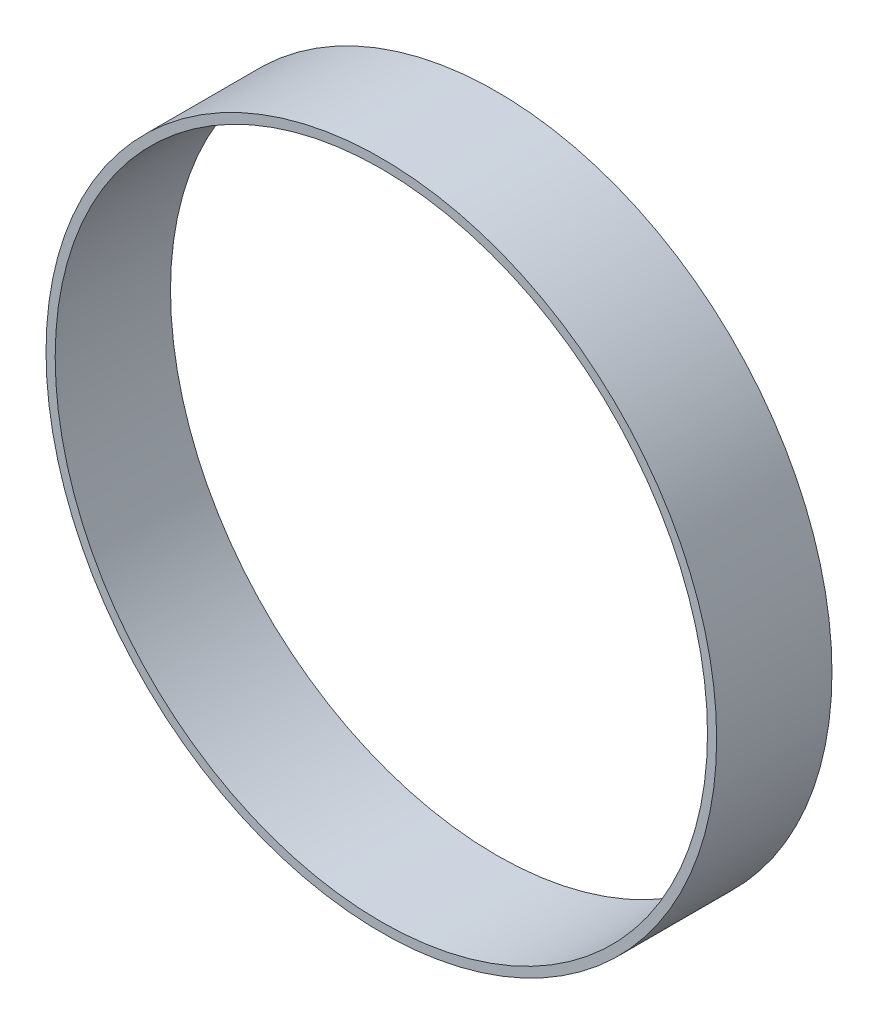
ISO-10303-21;
HEADER;
FILE_DESCRIPTION(('STEP AP214'),'2;1');
FILE_NAME('part.step','',(''),(''),'','','');
FILE_SCHEMA(('AUTOMOTIVE_DESIGN { 1 0 10303 214 1 1 1 1 }'));
ENDSEC;
DATA;
#1=APPLICATION_CONTEXT('core data for automotive mechanical design processes');
#2=APPLICATION_PROTOCOL_DEFINITION('international standard','automotive_design',2000,#1);
#3=PRODUCT_CONTEXT('',#1,'mechanical');
#4=PRODUCT('Part','Part','',(#3));
#5=PRODUCT_RELATED_PRODUCT_CATEGORY('part','',(#4));
#6=PRODUCT_DEFINITION_FORMATION('','',#4);
#7=PRODUCT_DEFINITION_CONTEXT('part definition',#1,'design');
#8=PRODUCT_DEFINITION('design','',#6,#7);
#9=PRODUCT_DEFINITION_SHAPE('','',#8);
#10=(LENGTH_UNIT() NAMED_UNIT(*) SI_UNIT(.MILLI.,.METRE.));
#11=(NAMED_UNIT(*) PLANE_ANGLE_UNIT() SI_UNIT($,.RADIAN.));
#12=(NAMED_UNIT(*) SI_UNIT($,.STERADIAN.) SOLID_ANGLE_UNIT());
#13=UNCERTAINTY_MEASURE_WITH_UNIT(LENGTH_MEASURE(1.E-05),#10,'distance_accuracy_value','');
#14=(GEOMETRIC_REPRESENTATION_CONTEXT(3) GLOBAL_UNCERTAINTY_ASSIGNED_CONTEXT((#13)) GLOBAL_UNIT_ASSIGNED_CONTEXT((#10,
#11,#12)) REPRESENTATION_CONTEXT('',''));
#15=CARTESIAN_POINT('',(0.,0.,0.));
#16=DIRECTION('',(0.,0.,1.));
#17=DIRECTION('',(1.,0.,0.));
#18=AXIS2_PLACEMENT_3D('',#15,#16,#17);
#19=CARTESIAN_POINT('',(0.,0.,5.));
#20=DIRECTION('',(0.,0.,1.));
#21=DIRECTION('',(1.,0.,0.));
#22=AXIS2_PLACEMENT_3D('',#19,#20,#21);
#23=PLANE('',#22);
#24=CARTESIAN_POINT('',(0.,0.,5.));
#25=DIRECTION('',(0.,0.,1.));
#26=DIRECTION('',(1.,0.,0.));
#27=AXIS2_PLACEMENT_3D('',#24,#25,#26);
#28=CIRCLE('',#27,29.075);
#29=CARTESIAN_POINT('',(29.075,0.,5.));
#30=VERTEX_POINT('',#29);
#31=EDGE_CURVE('E11',#30,#30,#28,.T.);
#32=ORIENTED_EDGE('',*,*,#31,.T.);
#33=EDGE_LOOP('',(#32));
#34=FACE_BOUND('',#33,.T.);
#35=CARTESIAN_POINT('',(0.,0.,5.));
#36=DIRECTION('',(0.,0.,1.));
#37=DIRECTION('',(1.,0.,0.));
#38=AXIS2_PLACEMENT_3D('',#35,#36,#37);
#39=CIRCLE('',#38,28.28125);
#40=CARTESIAN_POINT('',(28.28125,0.,5.));
#41=VERTEX_POINT('',#40);
#42=EDGE_CURVE('E47',#41,#41,#39,.T.);
#43=ORIENTED_EDGE('',*,*,#42,.F.);
#44=EDGE_LOOP('',(#43));
#45=FACE_BOUND('',#44,.T.);
#46=ADVANCED_FACE('F36',(#34,#45),#23,.T.);
#47=CARTESIAN_POINT('',(0.,0.,-5.));
#48=DIRECTION('',(0.,0.,1.));
#49=DIRECTION('',(1.,0.,0.));
#50=AXIS2_PLACEMENT_3D('',#47,#48,#49);
#51=PLANE('',#50);
#52=CARTESIAN_POINT('',(0.,0.,-5.));
#53=DIRECTION('',(0.,0.,1.));
#54=DIRECTION('',(1.,0.,0.));
#55=AXIS2_PLACEMENT_3D('',#52,#53,#54);
#56=CIRCLE('',#55,29.075);
#57=CARTESIAN_POINT('',(29.075,0.,-5.));
#58=VERTEX_POINT('',#57);
#59=EDGE_CURVE('E40',#58,#58,#56,.T.);
#60=ORIENTED_EDGE('',*,*,#59,.F.);
#61=EDGE_LOOP('',(#60));
#62=FACE_BOUND('',#61,.T.);
#63=CARTESIAN_POINT('',(0.,0.,-5.));
#64=DIRECTION('',(0.,0.,1.));
#65=DIRECTION('',(1.,0.,0.));
#66=AXIS2_PLACEMENT_3D('',#63,#64,#65);
#67=CIRCLE('',#66,28.28125);
#68=CARTESIAN_POINT('',(28.28125,0.,-5.));
#69=VERTEX_POINT('',#68);
#70=EDGE_CURVE('E49',#69,#69,#67,.T.);
#71=ORIENTED_EDGE('',*,*,#70,.T.);
#72=EDGE_LOOP('',(#71));
#73=FACE_BOUND('',#72,.T.);
#74=ADVANCED_FACE('F59',(#62,#73),#51,.F.);
#75=CARTESIAN_POINT('',(0.,0.,5.));
#76=DIRECTION('',(0.,0.,-1.));
#77=DIRECTION('',(-1.,0.,0.));
#78=AXIS2_PLACEMENT_3D('',#75,#76,#77);
#79=CYLINDRICAL_SURFACE('',#78,29.075);
#80=ORIENTED_EDGE('',*,*,#31,.F.);
#81=EDGE_LOOP('',(#80));
#82=FACE_BOUND('',#81,.T.);
#83=ORIENTED_EDGE('',*,*,#59,.T.);
#84=EDGE_LOOP('',(#83));
#85=FACE_BOUND('',#84,.T.);
#86=ADVANCED_FACE('F38',(#82,#85),#79,.T.);
#87=CARTESIAN_POINT('',(0.,0.,5.));
#88=DIRECTION('',(0.,0.,-1.));
#89=DIRECTION('',(-1.,0.,0.));
#90=AXIS2_PLACEMENT_3D('',#87,#88,#89);
#91=CYLINDRICAL_SURFACE('',#90,28.28125);
#92=ORIENTED_EDGE('',*,*,#42,.T.);
#93=EDGE_LOOP('',(#92));
#94=FACE_BOUND('',#93,.T.);
#95=ORIENTED_EDGE('',*,*,#70,.F.);
#96=EDGE_LOOP('',(#95));
#97=FACE_BOUND('',#96,.T.);
#98=ADVANCED_FACE('F55',(#94,#97),#91,.F.);
#99=CLOSED_SHELL('',(#46,#74,#86,#98));
#100=MANIFOLD_SOLID_BREP('B2',#99);
#101=ADVANCED_BREP_SHAPE_REPRESENTATION('',(#18,#100),#14);
#102=SHAPE_DEFINITION_REPRESENTATION(#9,#101);
ENDSEC;
END-ISO-10303-21;
